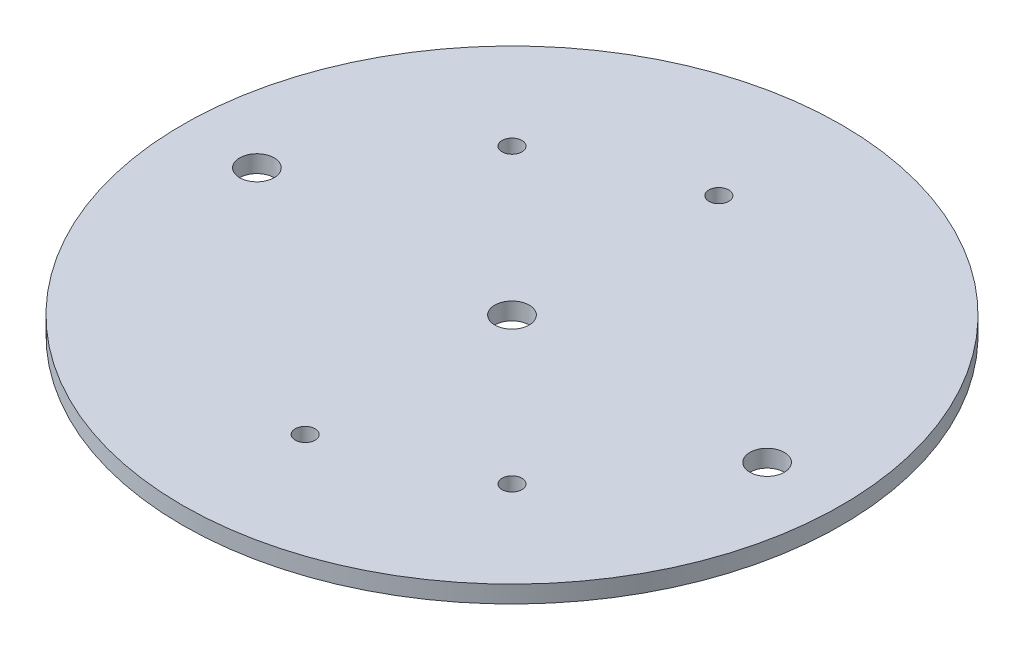
ISO-10303-21;
HEADER;
FILE_DESCRIPTION(('STEP AP214'),'2;1');
FILE_NAME('part.step','',(''),(''),'','','');
FILE_SCHEMA(('AUTOMOTIVE_DESIGN { 1 0 10303 214 1 1 1 1 }'));
ENDSEC;
DATA;
#1=APPLICATION_CONTEXT('core data for automotive mechanical design processes');
#2=APPLICATION_PROTOCOL_DEFINITION('international standard','automotive_design',2000,#1);
#3=PRODUCT_CONTEXT('',#1,'mechanical');
#4=PRODUCT('Part','Part','',(#3));
#5=PRODUCT_RELATED_PRODUCT_CATEGORY('part','',(#4));
#6=PRODUCT_DEFINITION_FORMATION('','',#4);
#7=PRODUCT_DEFINITION_CONTEXT('part definition',#1,'design');
#8=PRODUCT_DEFINITION('design','',#6,#7);
#9=PRODUCT_DEFINITION_SHAPE('','',#8);
#10=(LENGTH_UNIT() NAMED_UNIT(*) SI_UNIT(.MILLI.,.METRE.));
#11=(NAMED_UNIT(*) PLANE_ANGLE_UNIT() SI_UNIT($,.RADIAN.));
#12=(NAMED_UNIT(*) SI_UNIT($,.STERADIAN.) SOLID_ANGLE_UNIT());
#13=UNCERTAINTY_MEASURE_WITH_UNIT(LENGTH_MEASURE(1.E-05),#10,'distance_accuracy_value','');
#14=(GEOMETRIC_REPRESENTATION_CONTEXT(3) GLOBAL_UNCERTAINTY_ASSIGNED_CONTEXT((#13)) GLOBAL_UNIT_ASSIGNED_CONTEXT((#10,
#11,#12)) REPRESENTATION_CONTEXT('',''));
#15=CARTESIAN_POINT('',(0.,0.,0.));
#16=DIRECTION('',(0.,0.,1.));
#17=DIRECTION('',(1.,0.,0.));
#18=AXIS2_PLACEMENT_3D('',#15,#16,#17);
#19=CARTESIAN_POINT('',(0.,3.175,0.));
#20=DIRECTION('',(0.,1.,0.));
#21=DIRECTION('',(0.,0.,1.));
#22=AXIS2_PLACEMENT_3D('',#19,#20,#21);
#23=PLANE('',#22);
#24=CARTESIAN_POINT('',(-26.9407683632074,3.175,-26.9407683632075));
#25=DIRECTION('',(0.,1.,0.));
#26=DIRECTION('',(0.,0.,1.));
#27=AXIS2_PLACEMENT_3D('',#24,#25,#26);
#28=CIRCLE('',#27,1.8288);
#29=CARTESIAN_POINT('',(-26.9407683632074,3.175,-25.1119683632075));
#30=VERTEX_POINT('',#29);
#31=EDGE_CURVE('E92',#30,#30,#28,.T.);
#32=ORIENTED_EDGE('',*,*,#31,.F.);
#33=EDGE_LOOP('',(#32));
#34=FACE_BOUND('',#33,.T.);
#35=CARTESIAN_POINT('',(0.,3.175,-38.1));
#36=DIRECTION('',(0.,1.,0.));
#37=DIRECTION('',(0.,0.,1.));
#38=AXIS2_PLACEMENT_3D('',#35,#36,#37);
#39=CIRCLE('',#38,1.8288);
#40=CARTESIAN_POINT('',(0.,3.175,-36.2712));
#41=VERTEX_POINT('',#40);
#42=EDGE_CURVE('E76',#41,#41,#39,.T.);
#43=ORIENTED_EDGE('',*,*,#42,.F.);
#44=EDGE_LOOP('',(#43));
#45=FACE_BOUND('',#44,.T.);
#46=CARTESIAN_POINT('',(46.99,3.175,0.));
#47=DIRECTION('',(0.,1.,0.));
#48=DIRECTION('',(0.,0.,1.));
#49=AXIS2_PLACEMENT_3D('',#46,#47,#48);
#50=CIRCLE('',#49,3.175);
#51=CARTESIAN_POINT('',(46.99,3.175,3.17499999999998));
#52=VERTEX_POINT('',#51);
#53=EDGE_CURVE('E60',#52,#52,#50,.T.);
#54=ORIENTED_EDGE('',*,*,#53,.F.);
#55=EDGE_LOOP('',(#54));
#56=FACE_BOUND('',#55,.T.);
#57=CARTESIAN_POINT('',(0.,3.175,0.));
#58=DIRECTION('',(0.,1.,0.));
#59=DIRECTION('',(0.,0.,1.));
#60=AXIS2_PLACEMENT_3D('',#57,#58,#59);
#61=CIRCLE('',#60,60.706);
#62=CARTESIAN_POINT('',(0.,3.175,60.706));
#63=VERTEX_POINT('',#62);
#64=EDGE_CURVE('E10',#63,#63,#61,.T.);
#65=ORIENTED_EDGE('',*,*,#64,.T.);
#66=EDGE_LOOP('',(#65));
#67=FACE_BOUND('',#66,.T.);
#68=CARTESIAN_POINT('',(-46.99,3.175,0.));
#69=DIRECTION('',(0.,1.,0.));
#70=DIRECTION('',(0.,0.,1.));
#71=AXIS2_PLACEMENT_3D('',#68,#69,#70);
#72=CIRCLE('',#71,3.175);
#73=CARTESIAN_POINT('',(-46.99,3.175,3.175));
#74=VERTEX_POINT('',#73);
#75=EDGE_CURVE('E54',#74,#74,#72,.T.);
#76=ORIENTED_EDGE('',*,*,#75,.F.);
#77=EDGE_LOOP('',(#76));
#78=FACE_BOUND('',#77,.T.);
#79=CARTESIAN_POINT('',(0.,3.175,0.));
#80=DIRECTION('',(0.,1.,0.));
#81=DIRECTION('',(0.,0.,1.));
#82=AXIS2_PLACEMENT_3D('',#79,#80,#81);
#83=CIRCLE('',#82,3.175);
#84=CARTESIAN_POINT('',(0.,3.175,3.175));
#85=VERTEX_POINT('',#84);
#86=EDGE_CURVE('E68',#85,#85,#83,.T.);
#87=ORIENTED_EDGE('',*,*,#86,.F.);
#88=EDGE_LOOP('',(#87));
#89=FACE_BOUND('',#88,.T.);
#90=CARTESIAN_POINT('',(0.,3.175,38.1));
#91=DIRECTION('',(0.,1.,0.));
#92=DIRECTION('',(0.,0.,1.));
#93=AXIS2_PLACEMENT_3D('',#90,#91,#92);
#94=CIRCLE('',#93,1.8288);
#95=CARTESIAN_POINT('',(0.,3.175,39.9288));
#96=VERTEX_POINT('',#95);
#97=EDGE_CURVE('E84',#96,#96,#94,.T.);
#98=ORIENTED_EDGE('',*,*,#97,.F.);
#99=EDGE_LOOP('',(#98));
#100=FACE_BOUND('',#99,.T.);
#101=CARTESIAN_POINT('',(26.9407683632074,3.175,26.9407683632075));
#102=DIRECTION('',(0.,1.,0.));
#103=DIRECTION('',(0.,0.,1.));
#104=AXIS2_PLACEMENT_3D('',#101,#102,#103);
#105=CIRCLE('',#104,1.8288);
#106=CARTESIAN_POINT('',(26.9407683632074,3.175,28.7695683632075));
#107=VERTEX_POINT('',#106);
#108=EDGE_CURVE('E100',#107,#107,#105,.T.);
#109=ORIENTED_EDGE('',*,*,#108,.F.);
#110=EDGE_LOOP('',(#109));
#111=FACE_BOUND('',#110,.T.);
#112=ADVANCED_FACE('F41',(#34,#45,#56,#67,#78,#89,#100,#111),#23,.T.);
#113=CARTESIAN_POINT('',(0.,0.,0.));
#114=DIRECTION('',(0.,1.,0.));
#115=DIRECTION('',(0.,0.,1.));
#116=AXIS2_PLACEMENT_3D('',#113,#114,#115);
#117=PLANE('',#116);
#118=CARTESIAN_POINT('',(0.,0.,0.));
#119=DIRECTION('',(0.,1.,0.));
#120=DIRECTION('',(0.,0.,1.));
#121=AXIS2_PLACEMENT_3D('',#118,#119,#120);
#122=CIRCLE('',#121,60.706);
#123=CARTESIAN_POINT('',(0.,0.,60.706));
#124=VERTEX_POINT('',#123);
#125=EDGE_CURVE('E45',#124,#124,#122,.T.);
#126=ORIENTED_EDGE('',*,*,#125,.F.);
#127=EDGE_LOOP('',(#126));
#128=FACE_BOUND('',#127,.T.);
#129=CARTESIAN_POINT('',(-46.99,0.,0.));
#130=DIRECTION('',(0.,1.,0.));
#131=DIRECTION('',(0.,0.,1.));
#132=AXIS2_PLACEMENT_3D('',#129,#130,#131);
#133=CIRCLE('',#132,3.175);
#134=CARTESIAN_POINT('',(-46.99,0.,3.175));
#135=VERTEX_POINT('',#134);
#136=EDGE_CURVE('E56',#135,#135,#133,.T.);
#137=ORIENTED_EDGE('',*,*,#136,.T.);
#138=EDGE_LOOP('',(#137));
#139=FACE_BOUND('',#138,.T.);
#140=CARTESIAN_POINT('',(46.99,0.,0.));
#141=DIRECTION('',(0.,1.,0.));
#142=DIRECTION('',(0.,0.,1.));
#143=AXIS2_PLACEMENT_3D('',#140,#141,#142);
#144=CIRCLE('',#143,3.175);
#145=CARTESIAN_POINT('',(46.99,0.,3.17499999999998));
#146=VERTEX_POINT('',#145);
#147=EDGE_CURVE('E64',#146,#146,#144,.T.);
#148=ORIENTED_EDGE('',*,*,#147,.T.);
#149=EDGE_LOOP('',(#148));
#150=FACE_BOUND('',#149,.T.);
#151=CARTESIAN_POINT('',(0.,0.,0.));
#152=DIRECTION('',(0.,1.,0.));
#153=DIRECTION('',(0.,0.,1.));
#154=AXIS2_PLACEMENT_3D('',#151,#152,#153);
#155=CIRCLE('',#154,3.175);
#156=CARTESIAN_POINT('',(0.,0.,3.175));
#157=VERTEX_POINT('',#156);
#158=EDGE_CURVE('E72',#157,#157,#155,.T.);
#159=ORIENTED_EDGE('',*,*,#158,.T.);
#160=EDGE_LOOP('',(#159));
#161=FACE_BOUND('',#160,.T.);
#162=CARTESIAN_POINT('',(0.,0.,-38.1));
#163=DIRECTION('',(0.,1.,0.));
#164=DIRECTION('',(0.,0.,1.));
#165=AXIS2_PLACEMENT_3D('',#162,#163,#164);
#166=CIRCLE('',#165,1.8288);
#167=CARTESIAN_POINT('',(0.,0.,-36.2712));
#168=VERTEX_POINT('',#167);
#169=EDGE_CURVE('E80',#168,#168,#166,.T.);
#170=ORIENTED_EDGE('',*,*,#169,.T.);
#171=EDGE_LOOP('',(#170));
#172=FACE_BOUND('',#171,.T.);
#173=CARTESIAN_POINT('',(0.,0.,38.1));
#174=DIRECTION('',(0.,1.,0.));
#175=DIRECTION('',(0.,0.,1.));
#176=AXIS2_PLACEMENT_3D('',#173,#174,#175);
#177=CIRCLE('',#176,1.8288);
#178=CARTESIAN_POINT('',(0.,0.,39.9288));
#179=VERTEX_POINT('',#178);
#180=EDGE_CURVE('E88',#179,#179,#177,.T.);
#181=ORIENTED_EDGE('',*,*,#180,.T.);
#182=EDGE_LOOP('',(#181));
#183=FACE_BOUND('',#182,.T.);
#184=CARTESIAN_POINT('',(-26.9407683632074,0.,-26.9407683632075));
#185=DIRECTION('',(0.,1.,0.));
#186=DIRECTION('',(0.,0.,1.));
#187=AXIS2_PLACEMENT_3D('',#184,#185,#186);
#188=CIRCLE('',#187,1.8288);
#189=CARTESIAN_POINT('',(-26.9407683632074,0.,-25.1119683632075));
#190=VERTEX_POINT('',#189);
#191=EDGE_CURVE('E96',#190,#190,#188,.T.);
#192=ORIENTED_EDGE('',*,*,#191,.T.);
#193=EDGE_LOOP('',(#192));
#194=FACE_BOUND('',#193,.T.);
#195=CARTESIAN_POINT('',(26.9407683632074,0.,26.9407683632075));
#196=DIRECTION('',(0.,1.,0.));
#197=DIRECTION('',(0.,0.,1.));
#198=AXIS2_PLACEMENT_3D('',#195,#196,#197);
#199=CIRCLE('',#198,1.8288);
#200=CARTESIAN_POINT('',(26.9407683632074,0.,28.7695683632075));
#201=VERTEX_POINT('',#200);
#202=EDGE_CURVE('E104',#201,#201,#199,.T.);
#203=ORIENTED_EDGE('',*,*,#202,.T.);
#204=EDGE_LOOP('',(#203));
#205=FACE_BOUND('',#204,.T.);
#206=ADVANCED_FACE('F116',(#128,#139,#150,#161,#172,#183,#194,#205),#117,.F.);
#207=CARTESIAN_POINT('',(0.,3.175,0.));
#208=DIRECTION('',(0.,-1.,0.));
#209=DIRECTION('',(0.,0.,-1.));
#210=AXIS2_PLACEMENT_3D('',#207,#208,#209);
#211=CYLINDRICAL_SURFACE('',#210,60.706);
#212=ORIENTED_EDGE('',*,*,#64,.F.);
#213=EDGE_LOOP('',(#212));
#214=FACE_BOUND('',#213,.T.);
#215=ORIENTED_EDGE('',*,*,#125,.T.);
#216=EDGE_LOOP('',(#215));
#217=FACE_BOUND('',#216,.T.);
#218=ADVANCED_FACE('F43',(#214,#217),#211,.T.);
#219=CARTESIAN_POINT('',(-46.99,3.175,0.));
#220=DIRECTION('',(0.,-1.,0.));
#221=DIRECTION('',(0.,0.,-1.));
#222=AXIS2_PLACEMENT_3D('',#219,#220,#221);
#223=CYLINDRICAL_SURFACE('',#222,3.175);
#224=ORIENTED_EDGE('',*,*,#75,.T.);
#225=EDGE_LOOP('',(#224));
#226=FACE_BOUND('',#225,.T.);
#227=ORIENTED_EDGE('',*,*,#136,.F.);
#228=EDGE_LOOP('',(#227));
#229=FACE_BOUND('',#228,.T.);
#230=ADVANCED_FACE('F126',(#226,#229),#223,.F.);
#231=CARTESIAN_POINT('',(46.99,3.175,0.));
#232=DIRECTION('',(0.,-1.,0.));
#233=DIRECTION('',(0.,0.,-1.));
#234=AXIS2_PLACEMENT_3D('',#231,#232,#233);
#235=CYLINDRICAL_SURFACE('',#234,3.175);
#236=ORIENTED_EDGE('',*,*,#53,.T.);
#237=EDGE_LOOP('',(#236));
#238=FACE_BOUND('',#237,.T.);
#239=ORIENTED_EDGE('',*,*,#147,.F.);
#240=EDGE_LOOP('',(#239));
#241=FACE_BOUND('',#240,.T.);
#242=ADVANCED_FACE('F129',(#238,#241),#235,.F.);
#243=CARTESIAN_POINT('',(0.,3.175,0.));
#244=DIRECTION('',(0.,-1.,0.));
#245=DIRECTION('',(0.,0.,-1.));
#246=AXIS2_PLACEMENT_3D('',#243,#244,#245);
#247=CYLINDRICAL_SURFACE('',#246,3.175);
#248=ORIENTED_EDGE('',*,*,#86,.T.);
#249=EDGE_LOOP('',(#248));
#250=FACE_BOUND('',#249,.T.);
#251=ORIENTED_EDGE('',*,*,#158,.F.);
#252=EDGE_LOOP('',(#251));
#253=FACE_BOUND('',#252,.T.);
#254=ADVANCED_FACE('F133',(#250,#253),#247,.F.);
#255=CARTESIAN_POINT('',(0.,3.175,-38.1));
#256=DIRECTION('',(0.,-1.,0.));
#257=DIRECTION('',(0.,0.,-1.));
#258=AXIS2_PLACEMENT_3D('',#255,#256,#257);
#259=CYLINDRICAL_SURFACE('',#258,1.8288);
#260=ORIENTED_EDGE('',*,*,#42,.T.);
#261=EDGE_LOOP('',(#260));
#262=FACE_BOUND('',#261,.T.);
#263=ORIENTED_EDGE('',*,*,#169,.F.);
#264=EDGE_LOOP('',(#263));
#265=FACE_BOUND('',#264,.T.);
#266=ADVANCED_FACE('F137',(#262,#265),#259,.F.);
#267=CARTESIAN_POINT('',(0.,3.175,38.1));
#268=DIRECTION('',(0.,-1.,0.));
#269=DIRECTION('',(0.,0.,-1.));
#270=AXIS2_PLACEMENT_3D('',#267,#268,#269);
#271=CYLINDRICAL_SURFACE('',#270,1.8288);
#272=ORIENTED_EDGE('',*,*,#97,.T.);
#273=EDGE_LOOP('',(#272));
#274=FACE_BOUND('',#273,.T.);
#275=ORIENTED_EDGE('',*,*,#180,.F.);
#276=EDGE_LOOP('',(#275));
#277=FACE_BOUND('',#276,.T.);
#278=ADVANCED_FACE('F141',(#274,#277),#271,.F.);
#279=CARTESIAN_POINT('',(-26.9407683632074,3.175,-26.9407683632075));
#280=DIRECTION('',(0.,-1.,0.));
#281=DIRECTION('',(0.,0.,-1.));
#282=AXIS2_PLACEMENT_3D('',#279,#280,#281);
#283=CYLINDRICAL_SURFACE('',#282,1.8288);
#284=ORIENTED_EDGE('',*,*,#31,.T.);
#285=EDGE_LOOP('',(#284));
#286=FACE_BOUND('',#285,.T.);
#287=ORIENTED_EDGE('',*,*,#191,.F.);
#288=EDGE_LOOP('',(#287));
#289=FACE_BOUND('',#288,.T.);
#290=ADVANCED_FACE('F145',(#286,#289),#283,.F.);
#291=CARTESIAN_POINT('',(26.9407683632074,3.175,26.9407683632075));
#292=DIRECTION('',(0.,-1.,0.));
#293=DIRECTION('',(0.,0.,-1.));
#294=AXIS2_PLACEMENT_3D('',#291,#292,#293);
#295=CYLINDRICAL_SURFACE('',#294,1.8288);
#296=ORIENTED_EDGE('',*,*,#108,.T.);
#297=EDGE_LOOP('',(#296));
#298=FACE_BOUND('',#297,.T.);
#299=ORIENTED_EDGE('',*,*,#202,.F.);
#300=EDGE_LOOP('',(#299));
#301=FACE_BOUND('',#300,.T.);
#302=ADVANCED_FACE('F112',(#298,#301),#295,.F.);
#303=CLOSED_SHELL('',(#112,#206,#218,#230,#242,#254,#266,#278,#290,#302));
#304=MANIFOLD_SOLID_BREP('B2',#303);
#305=ADVANCED_BREP_SHAPE_REPRESENTATION('',(#18,#304),#14);
#306=SHAPE_DEFINITION_REPRESENTATION(#9,#305);
ENDSEC;
END-ISO-10303-21;
